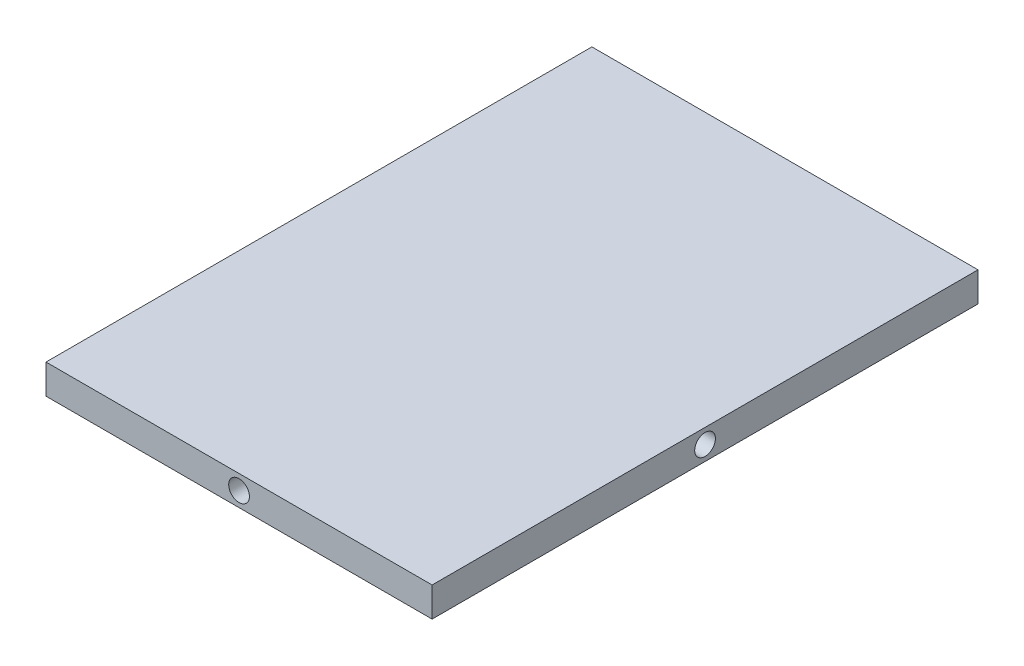
ISO-10303-21;
HEADER;
FILE_DESCRIPTION(('STEP AP214'),'2;1');
FILE_NAME('part.step','',(''),(''),'','','');
FILE_SCHEMA(('AUTOMOTIVE_DESIGN { 1 0 10303 214 1 1 1 1 }'));
ENDSEC;
DATA;
#1=APPLICATION_CONTEXT('core data for automotive mechanical design processes');
#2=APPLICATION_PROTOCOL_DEFINITION('international standard','automotive_design',2000,#1);
#3=PRODUCT_CONTEXT('',#1,'mechanical');
#4=PRODUCT('Part','Part','',(#3));
#5=PRODUCT_RELATED_PRODUCT_CATEGORY('part','',(#4));
#6=PRODUCT_DEFINITION_FORMATION('','',#4);
#7=PRODUCT_DEFINITION_CONTEXT('part definition',#1,'design');
#8=PRODUCT_DEFINITION('design','',#6,#7);
#9=PRODUCT_DEFINITION_SHAPE('','',#8);
#10=(LENGTH_UNIT() NAMED_UNIT(*) SI_UNIT(.MILLI.,.METRE.));
#11=(NAMED_UNIT(*) PLANE_ANGLE_UNIT() SI_UNIT($,.RADIAN.));
#12=(NAMED_UNIT(*) SI_UNIT($,.STERADIAN.) SOLID_ANGLE_UNIT());
#13=UNCERTAINTY_MEASURE_WITH_UNIT(LENGTH_MEASURE(1.E-05),#10,'distance_accuracy_value','');
#14=(GEOMETRIC_REPRESENTATION_CONTEXT(3) GLOBAL_UNCERTAINTY_ASSIGNED_CONTEXT((#13)) GLOBAL_UNIT_ASSIGNED_CONTEXT((#10,
#11,#12)) REPRESENTATION_CONTEXT('',''));
#15=CARTESIAN_POINT('',(0.,0.,0.));
#16=DIRECTION('',(0.,0.,1.));
#17=DIRECTION('',(1.,0.,0.));
#18=AXIS2_PLACEMENT_3D('',#15,#16,#17);
#19=CARTESIAN_POINT('',(65.25,10.,92.25));
#20=DIRECTION('',(-1.,0.,0.));
#21=DIRECTION('',(0.,0.,1.));
#22=AXIS2_PLACEMENT_3D('',#19,#20,#21);
#23=PLANE('',#22);
#24=CARTESIAN_POINT('',(65.25,5.,0.));
#25=DIRECTION('',(1.,0.,0.));
#26=DIRECTION('',(0.,0.,-1.));
#27=AXIS2_PLACEMENT_3D('',#24,#25,#26);
#28=CIRCLE('',#27,3.5);
#29=CARTESIAN_POINT('',(65.25,5.,-3.49999999999997));
#30=VERTEX_POINT('',#29);
#31=EDGE_CURVE('E136',#30,#30,#28,.T.);
#32=ORIENTED_EDGE('',*,*,#31,.F.);
#33=EDGE_LOOP('',(#32));
#34=FACE_BOUND('',#33,.T.);
#35=DIRECTION('',(0.,0.,-1.));
#36=VECTOR('',#35,1.);
#37=CARTESIAN_POINT('',(65.25,0.,92.25));
#38=LINE('',#37,#36);
#39=CARTESIAN_POINT('',(65.25,0.,92.25));
#40=VERTEX_POINT('',#39);
#41=CARTESIAN_POINT('',(65.25,0.,-92.25));
#42=VERTEX_POINT('',#41);
#43=EDGE_CURVE('E107',#40,#42,#38,.T.);
#44=ORIENTED_EDGE('',*,*,#43,.T.);
#45=DIRECTION('',(0.,-1.,0.));
#46=VECTOR('',#45,1.);
#47=CARTESIAN_POINT('',(65.25,10.,-92.25));
#48=LINE('',#47,#46);
#49=CARTESIAN_POINT('',(65.25,10.,-92.25));
#50=VERTEX_POINT('',#49);
#51=EDGE_CURVE('E11',#50,#42,#48,.T.);
#52=ORIENTED_EDGE('',*,*,#51,.F.);
#53=DIRECTION('',(0.,0.,-1.));
#54=VECTOR('',#53,1.);
#55=CARTESIAN_POINT('',(65.25,10.,92.25));
#56=LINE('',#55,#54);
#57=CARTESIAN_POINT('',(65.25,10.,92.25));
#58=VERTEX_POINT('',#57);
#59=EDGE_CURVE('E91',#58,#50,#56,.T.);
#60=ORIENTED_EDGE('',*,*,#59,.F.);
#61=DIRECTION('',(0.,-1.,0.));
#62=VECTOR('',#61,1.);
#63=CARTESIAN_POINT('',(65.25,10.,92.25));
#64=LINE('',#63,#62);
#65=EDGE_CURVE('E103',#58,#40,#64,.T.);
#66=ORIENTED_EDGE('',*,*,#65,.T.);
#67=EDGE_LOOP('',(#44,#52,#60,#66));
#68=FACE_BOUND('',#67,.T.);
#69=ADVANCED_FACE('F39',(#34,#68),#23,.F.);
#70=CARTESIAN_POINT('',(-65.25,10.,-92.25));
#71=DIRECTION('',(0.,0.,1.));
#72=DIRECTION('',(1.,0.,0.));
#73=AXIS2_PLACEMENT_3D('',#70,#71,#72);
#74=PLANE('',#73);
#75=CARTESIAN_POINT('',(0.,5.,-92.25));
#76=DIRECTION('',(0.,0.,-1.));
#77=DIRECTION('',(-1.,0.,0.));
#78=AXIS2_PLACEMENT_3D('',#75,#76,#77);
#79=CIRCLE('',#78,3.5);
#80=CARTESIAN_POINT('',(-3.5,5.,-92.25));
#81=VERTEX_POINT('',#80);
#82=EDGE_CURVE('E144',#81,#81,#79,.T.);
#83=ORIENTED_EDGE('',*,*,#82,.F.);
#84=EDGE_LOOP('',(#83));
#85=FACE_BOUND('',#84,.T.);
#86=DIRECTION('',(-1.,0.,0.));
#87=VECTOR('',#86,1.);
#88=CARTESIAN_POINT('',(-65.25,0.,-92.25));
#89=LINE('',#88,#87);
#90=CARTESIAN_POINT('',(-65.25,0.,-92.25));
#91=VERTEX_POINT('',#90);
#92=EDGE_CURVE('E96',#42,#91,#89,.T.);
#93=ORIENTED_EDGE('',*,*,#92,.T.);
#94=DIRECTION('',(0.,-1.,0.));
#95=VECTOR('',#94,1.);
#96=CARTESIAN_POINT('',(-65.25,10.,-92.25));
#97=LINE('',#96,#95);
#98=CARTESIAN_POINT('',(-65.25,10.,-92.25));
#99=VERTEX_POINT('',#98);
#100=EDGE_CURVE('E48',#99,#91,#97,.T.);
#101=ORIENTED_EDGE('',*,*,#100,.F.);
#102=DIRECTION('',(-1.,0.,0.));
#103=VECTOR('',#102,1.);
#104=CARTESIAN_POINT('',(-65.25,10.,-92.25));
#105=LINE('',#104,#103);
#106=EDGE_CURVE('E86',#50,#99,#105,.T.);
#107=ORIENTED_EDGE('',*,*,#106,.F.);
#108=ORIENTED_EDGE('',*,*,#51,.T.);
#109=EDGE_LOOP('',(#93,#101,#107,#108));
#110=FACE_BOUND('',#109,.T.);
#111=ADVANCED_FACE('F95',(#85,#110),#74,.F.);
#112=CARTESIAN_POINT('',(-65.25,10.,92.25));
#113=DIRECTION('',(1.,0.,0.));
#114=DIRECTION('',(0.,0.,-1.));
#115=AXIS2_PLACEMENT_3D('',#112,#113,#114);
#116=PLANE('',#115);
#117=CARTESIAN_POINT('',(-65.25,5.,0.));
#118=DIRECTION('',(-1.,0.,0.));
#119=DIRECTION('',(0.,0.,1.));
#120=AXIS2_PLACEMENT_3D('',#117,#118,#119);
#121=CIRCLE('',#120,3.5);
#122=CARTESIAN_POINT('',(-65.25,5.,3.49999999999997));
#123=VERTEX_POINT('',#122);
#124=EDGE_CURVE('E152',#123,#123,#121,.T.);
#125=ORIENTED_EDGE('',*,*,#124,.F.);
#126=EDGE_LOOP('',(#125));
#127=FACE_BOUND('',#126,.T.);
#128=DIRECTION('',(0.,0.,1.));
#129=VECTOR('',#128,1.);
#130=CARTESIAN_POINT('',(-65.25,0.,92.25));
#131=LINE('',#130,#129);
#132=CARTESIAN_POINT('',(-65.25,0.,92.25));
#133=VERTEX_POINT('',#132);
#134=EDGE_CURVE('E73',#91,#133,#131,.T.);
#135=ORIENTED_EDGE('',*,*,#134,.T.);
#136=DIRECTION('',(0.,-1.,0.));
#137=VECTOR('',#136,1.);
#138=CARTESIAN_POINT('',(-65.25,10.,92.25));
#139=LINE('',#138,#137);
#140=CARTESIAN_POINT('',(-65.25,10.,92.25));
#141=VERTEX_POINT('',#140);
#142=EDGE_CURVE('E98',#141,#133,#139,.T.);
#143=ORIENTED_EDGE('',*,*,#142,.F.);
#144=DIRECTION('',(0.,0.,1.));
#145=VECTOR('',#144,1.);
#146=CARTESIAN_POINT('',(-65.25,10.,92.25));
#147=LINE('',#146,#145);
#148=EDGE_CURVE('E89',#99,#141,#147,.T.);
#149=ORIENTED_EDGE('',*,*,#148,.F.);
#150=ORIENTED_EDGE('',*,*,#100,.T.);
#151=EDGE_LOOP('',(#135,#143,#149,#150));
#152=FACE_BOUND('',#151,.T.);
#153=ADVANCED_FACE('F99',(#127,#152),#116,.F.);
#154=CARTESIAN_POINT('',(-65.25,10.,92.25));
#155=DIRECTION('',(0.,0.,-1.));
#156=DIRECTION('',(-1.,0.,0.));
#157=AXIS2_PLACEMENT_3D('',#154,#155,#156);
#158=PLANE('',#157);
#159=CARTESIAN_POINT('',(0.,5.,92.25));
#160=DIRECTION('',(0.,0.,1.));
#161=DIRECTION('',(1.,0.,0.));
#162=AXIS2_PLACEMENT_3D('',#159,#160,#161);
#163=CIRCLE('',#162,3.5);
#164=CARTESIAN_POINT('',(3.50000000000003,5.,92.25));
#165=VERTEX_POINT('',#164);
#166=EDGE_CURVE('E128',#165,#165,#163,.T.);
#167=ORIENTED_EDGE('',*,*,#166,.F.);
#168=EDGE_LOOP('',(#167));
#169=FACE_BOUND('',#168,.T.);
#170=DIRECTION('',(1.,0.,0.));
#171=VECTOR('',#170,1.);
#172=CARTESIAN_POINT('',(-65.25,0.,92.25));
#173=LINE('',#172,#171);
#174=EDGE_CURVE('E79',#133,#40,#173,.T.);
#175=ORIENTED_EDGE('',*,*,#174,.T.);
#176=ORIENTED_EDGE('',*,*,#65,.F.);
#177=DIRECTION('',(1.,0.,0.));
#178=VECTOR('',#177,1.);
#179=CARTESIAN_POINT('',(-65.25,10.,92.25));
#180=LINE('',#179,#178);
#181=EDGE_CURVE('E56',#141,#58,#180,.T.);
#182=ORIENTED_EDGE('',*,*,#181,.F.);
#183=ORIENTED_EDGE('',*,*,#142,.T.);
#184=EDGE_LOOP('',(#175,#176,#182,#183));
#185=FACE_BOUND('',#184,.T.);
#186=ADVANCED_FACE('F121',(#169,#185),#158,.F.);
#187=CARTESIAN_POINT('',(0.,10.,0.));
#188=DIRECTION('',(0.,-1.,0.));
#189=DIRECTION('',(0.,0.,-1.));
#190=AXIS2_PLACEMENT_3D('',#187,#188,#189);
#191=PLANE('',#190);
#192=ORIENTED_EDGE('',*,*,#59,.T.);
#193=ORIENTED_EDGE('',*,*,#106,.T.);
#194=ORIENTED_EDGE('',*,*,#148,.T.);
#195=ORIENTED_EDGE('',*,*,#181,.T.);
#196=EDGE_LOOP('',(#192,#193,#194,#195));
#197=FACE_BOUND('',#196,.T.);
#198=ADVANCED_FACE('F87',(#197),#191,.F.);
#199=CARTESIAN_POINT('',(0.,0.,0.));
#200=DIRECTION('',(0.,-1.,0.));
#201=DIRECTION('',(0.,0.,-1.));
#202=AXIS2_PLACEMENT_3D('',#199,#200,#201);
#203=PLANE('',#202);
#204=ORIENTED_EDGE('',*,*,#43,.F.);
#205=ORIENTED_EDGE('',*,*,#174,.F.);
#206=ORIENTED_EDGE('',*,*,#134,.F.);
#207=ORIENTED_EDGE('',*,*,#92,.F.);
#208=EDGE_LOOP('',(#204,#205,#206,#207));
#209=FACE_BOUND('',#208,.T.);
#210=ADVANCED_FACE('F124',(#209),#203,.T.);
#211=CARTESIAN_POINT('',(0.,5.,82.25));
#212=DIRECTION('',(0.,0.,1.));
#213=DIRECTION('',(1.,0.,0.));
#214=AXIS2_PLACEMENT_3D('',#211,#212,#213);
#215=CYLINDRICAL_SURFACE('',#214,3.5);
#216=CARTESIAN_POINT('',(0.,5.,82.25));
#217=DIRECTION('',(0.,0.,1.));
#218=DIRECTION('',(1.,0.,0.));
#219=AXIS2_PLACEMENT_3D('',#216,#217,#218);
#220=CIRCLE('',#219,3.5);
#221=CARTESIAN_POINT('',(3.50000000000003,5.,82.25));
#222=VERTEX_POINT('',#221);
#223=EDGE_CURVE('E111',#222,#222,#220,.T.);
#224=ORIENTED_EDGE('',*,*,#223,.F.);
#225=EDGE_LOOP('',(#224));
#226=FACE_BOUND('',#225,.T.);
#227=ORIENTED_EDGE('',*,*,#166,.T.);
#228=EDGE_LOOP('',(#227));
#229=FACE_BOUND('',#228,.T.);
#230=ADVANCED_FACE('F197',(#226,#229),#215,.F.);
#231=CARTESIAN_POINT('',(0.,5.,82.25));
#232=DIRECTION('',(0.,0.,1.));
#233=DIRECTION('',(1.,0.,0.));
#234=AXIS2_PLACEMENT_3D('',#231,#232,#233);
#235=PLANE('',#234);
#236=ORIENTED_EDGE('',*,*,#223,.T.);
#237=EDGE_LOOP('',(#236));
#238=FACE_BOUND('',#237,.T.);
#239=ADVANCED_FACE('F187',(#238),#235,.T.);
#240=CARTESIAN_POINT('',(55.25,5.,0.));
#241=DIRECTION('',(1.,0.,0.));
#242=DIRECTION('',(0.,0.,-1.));
#243=AXIS2_PLACEMENT_3D('',#240,#241,#242);
#244=CYLINDRICAL_SURFACE('',#243,3.5);
#245=CARTESIAN_POINT('',(55.25,5.,0.));
#246=DIRECTION('',(1.,0.,0.));
#247=DIRECTION('',(0.,0.,-1.));
#248=AXIS2_PLACEMENT_3D('',#245,#246,#247);
#249=CIRCLE('',#248,3.5);
#250=CARTESIAN_POINT('',(55.25,5.,-3.49999999999997));
#251=VERTEX_POINT('',#250);
#252=EDGE_CURVE('E132',#251,#251,#249,.T.);
#253=ORIENTED_EDGE('',*,*,#252,.F.);
#254=EDGE_LOOP('',(#253));
#255=FACE_BOUND('',#254,.T.);
#256=ORIENTED_EDGE('',*,*,#31,.T.);
#257=EDGE_LOOP('',(#256));
#258=FACE_BOUND('',#257,.T.);
#259=ADVANCED_FACE('F184',(#255,#258),#244,.F.);
#260=CARTESIAN_POINT('',(55.25,5.,0.));
#261=DIRECTION('',(1.,0.,0.));
#262=DIRECTION('',(0.,0.,-1.));
#263=AXIS2_PLACEMENT_3D('',#260,#261,#262);
#264=PLANE('',#263);
#265=ORIENTED_EDGE('',*,*,#252,.T.);
#266=EDGE_LOOP('',(#265));
#267=FACE_BOUND('',#266,.T.);
#268=ADVANCED_FACE('F186',(#267),#264,.T.);
#269=CARTESIAN_POINT('',(0.,5.,-82.25));
#270=DIRECTION('',(0.,0.,-1.));
#271=DIRECTION('',(-1.,0.,0.));
#272=AXIS2_PLACEMENT_3D('',#269,#270,#271);
#273=CYLINDRICAL_SURFACE('',#272,3.5);
#274=CARTESIAN_POINT('',(0.,5.,-82.25));
#275=DIRECTION('',(0.,0.,-1.));
#276=DIRECTION('',(-1.,0.,0.));
#277=AXIS2_PLACEMENT_3D('',#274,#275,#276);
#278=CIRCLE('',#277,3.5);
#279=CARTESIAN_POINT('',(-3.5,5.,-82.25));
#280=VERTEX_POINT('',#279);
#281=EDGE_CURVE('E140',#280,#280,#278,.T.);
#282=ORIENTED_EDGE('',*,*,#281,.F.);
#283=EDGE_LOOP('',(#282));
#284=FACE_BOUND('',#283,.T.);
#285=ORIENTED_EDGE('',*,*,#82,.T.);
#286=EDGE_LOOP('',(#285));
#287=FACE_BOUND('',#286,.T.);
#288=ADVANCED_FACE('F194',(#284,#287),#273,.F.);
#289=CARTESIAN_POINT('',(0.,0.,-82.25));
#290=DIRECTION('',(0.,0.,-1.));
#291=DIRECTION('',(-1.,0.,0.));
#292=AXIS2_PLACEMENT_3D('',#289,#290,#291);
#293=PLANE('',#292);
#294=ORIENTED_EDGE('',*,*,#281,.T.);
#295=EDGE_LOOP('',(#294));
#296=FACE_BOUND('',#295,.T.);
#297=ADVANCED_FACE('F165',(#296),#293,.T.);
#298=CARTESIAN_POINT('',(-55.25,5.,0.));
#299=DIRECTION('',(-1.,0.,0.));
#300=DIRECTION('',(0.,0.,1.));
#301=AXIS2_PLACEMENT_3D('',#298,#299,#300);
#302=CYLINDRICAL_SURFACE('',#301,3.5);
#303=CARTESIAN_POINT('',(-55.25,5.,0.));
#304=DIRECTION('',(-1.,0.,0.));
#305=DIRECTION('',(0.,0.,1.));
#306=AXIS2_PLACEMENT_3D('',#303,#304,#305);
#307=CIRCLE('',#306,3.5);
#308=CARTESIAN_POINT('',(-55.25,5.,3.49999999999997));
#309=VERTEX_POINT('',#308);
#310=EDGE_CURVE('E148',#309,#309,#307,.T.);
#311=ORIENTED_EDGE('',*,*,#310,.F.);
#312=EDGE_LOOP('',(#311));
#313=FACE_BOUND('',#312,.T.);
#314=ORIENTED_EDGE('',*,*,#124,.T.);
#315=EDGE_LOOP('',(#314));
#316=FACE_BOUND('',#315,.T.);
#317=ADVANCED_FACE('F162',(#313,#316),#302,.F.);
#318=CARTESIAN_POINT('',(-55.25,5.,0.));
#319=DIRECTION('',(-1.,0.,0.));
#320=DIRECTION('',(0.,0.,1.));
#321=AXIS2_PLACEMENT_3D('',#318,#319,#320);
#322=PLANE('',#321);
#323=ORIENTED_EDGE('',*,*,#310,.T.);
#324=EDGE_LOOP('',(#323));
#325=FACE_BOUND('',#324,.T.);
#326=ADVANCED_FACE('F160',(#325),#322,.T.);
#327=CLOSED_SHELL('',(#69,#111,#153,#186,#198,#210,#230,#239,#259,#268,#288,#297,#317,#326));
#328=MANIFOLD_SOLID_BREP('B2',#327);
#329=ADVANCED_BREP_SHAPE_REPRESENTATION('',(#18,#328),#14);
#330=SHAPE_DEFINITION_REPRESENTATION(#9,#329);
ENDSEC;
END-ISO-10303-21;
